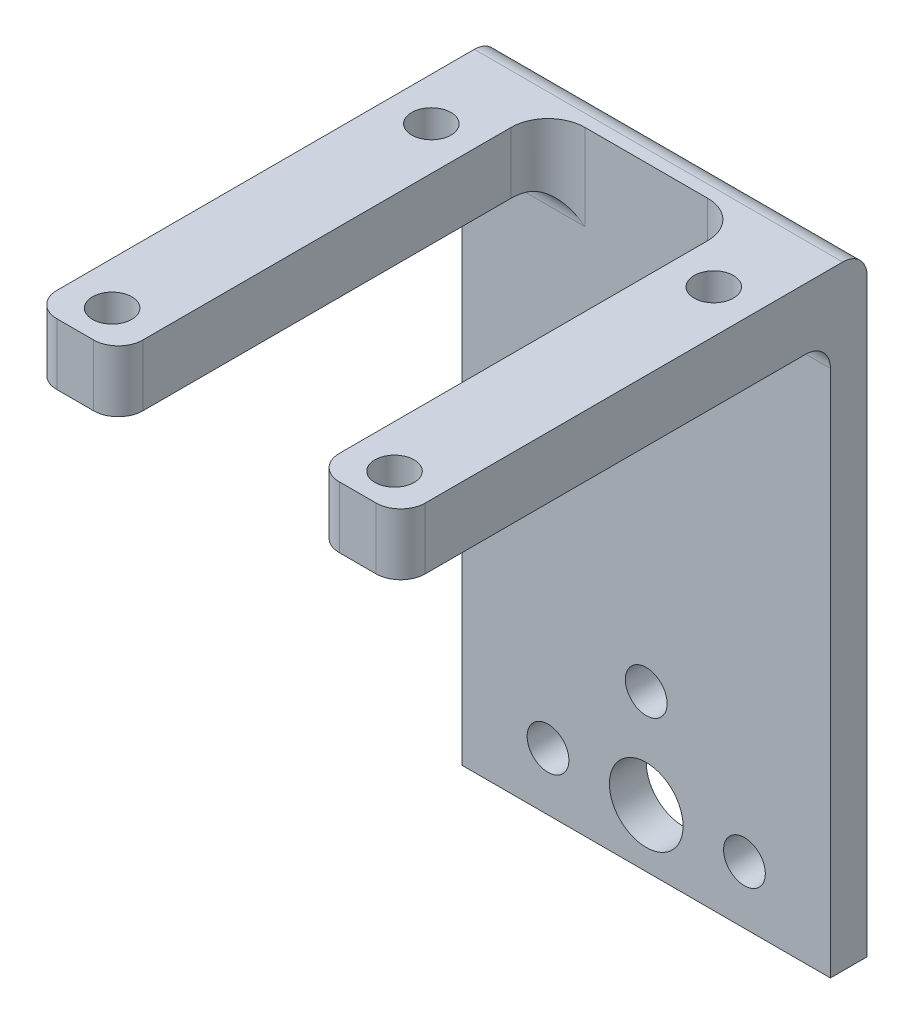
ISO-10303-21;
HEADER;
FILE_DESCRIPTION(('STEP AP214'),'2;1');
FILE_NAME('part.step','',(''),(''),'','','');
FILE_SCHEMA(('AUTOMOTIVE_DESIGN { 1 0 10303 214 1 1 1 1 }'));
ENDSEC;
DATA;
#1=APPLICATION_CONTEXT('core data for automotive mechanical design processes');
#2=APPLICATION_PROTOCOL_DEFINITION('international standard','automotive_design',2000,#1);
#3=PRODUCT_CONTEXT('',#1,'mechanical');
#4=PRODUCT('Part','Part','',(#3));
#5=PRODUCT_RELATED_PRODUCT_CATEGORY('part','',(#4));
#6=PRODUCT_DEFINITION_FORMATION('','',#4);
#7=PRODUCT_DEFINITION_CONTEXT('part definition',#1,'design');
#8=PRODUCT_DEFINITION('design','',#6,#7);
#9=PRODUCT_DEFINITION_SHAPE('','',#8);
#10=(LENGTH_UNIT() NAMED_UNIT(*) SI_UNIT(.MILLI.,.METRE.));
#11=(NAMED_UNIT(*) PLANE_ANGLE_UNIT() SI_UNIT($,.RADIAN.));
#12=(NAMED_UNIT(*) SI_UNIT($,.STERADIAN.) SOLID_ANGLE_UNIT());
#13=UNCERTAINTY_MEASURE_WITH_UNIT(LENGTH_MEASURE(1.E-05),#10,'distance_accuracy_value','');
#14=(GEOMETRIC_REPRESENTATION_CONTEXT(3) GLOBAL_UNCERTAINTY_ASSIGNED_CONTEXT((#13)) GLOBAL_UNIT_ASSIGNED_CONTEXT((#10,
#11,#12)) REPRESENTATION_CONTEXT('',''));
#15=CARTESIAN_POINT('',(0.,0.,0.));
#16=DIRECTION('',(0.,0.,1.));
#17=DIRECTION('',(1.,0.,0.));
#18=AXIS2_PLACEMENT_3D('',#15,#16,#17);
#19=CARTESIAN_POINT('',(-15.,146.664519158712,51.));
#20=DIRECTION('',(0.,1.,0.));
#21=DIRECTION('',(0.,0.,1.));
#22=AXIS2_PLACEMENT_3D('',#19,#20,#21);
#23=PLANE('',#22);
#24=CARTESIAN_POINT('',(-11.5,146.664519158712,22.));
#25=DIRECTION('',(0.,1.,0.));
#26=DIRECTION('',(0.,0.,1.));
#27=AXIS2_PLACEMENT_3D('',#24,#25,#26);
#28=CIRCLE('',#27,1.6);
#29=CARTESIAN_POINT('',(-11.5,146.664519158712,23.6));
#30=VERTEX_POINT('',#29);
#31=EDGE_CURVE('E246',#30,#30,#28,.T.);
#32=ORIENTED_EDGE('',*,*,#31,.T.);
#33=EDGE_LOOP('',(#32));
#34=FACE_BOUND('',#33,.T.);
#35=CARTESIAN_POINT('',(-11.5,146.664519158712,48.));
#36=DIRECTION('',(0.,1.,0.));
#37=DIRECTION('',(0.,0.,1.));
#38=AXIS2_PLACEMENT_3D('',#35,#36,#37);
#39=CIRCLE('',#38,1.6);
#40=CARTESIAN_POINT('',(-11.5,146.664519158712,49.6));
#41=VERTEX_POINT('',#40);
#42=EDGE_CURVE('E242',#41,#41,#39,.T.);
#43=ORIENTED_EDGE('',*,*,#42,.T.);
#44=EDGE_LOOP('',(#43));
#45=FACE_BOUND('',#44,.T.);
#46=DIRECTION('',(1.,0.,0.));
#47=VECTOR('',#46,1.);
#48=CARTESIAN_POINT('',(-15.,146.664519158712,51.));
#49=LINE('',#48,#47);
#50=CARTESIAN_POINT('',(-13.,146.664519158712,51.));
#51=VERTEX_POINT('',#50);
#52=CARTESIAN_POINT('',(-10.,146.664519158712,51.));
#53=VERTEX_POINT('',#52);
#54=EDGE_CURVE('E429',#51,#53,#49,.T.);
#55=ORIENTED_EDGE('',*,*,#54,.F.);
#56=CARTESIAN_POINT('',(-13.,146.664519158712,49.));
#57=DIRECTION('',(0.,1.,0.));
#58=DIRECTION('',(0.,0.,1.));
#59=AXIS2_PLACEMENT_3D('',#56,#57,#58);
#60=CIRCLE('',#59,2.);
#61=CARTESIAN_POINT('',(-15.,146.664519158712,49.));
#62=VERTEX_POINT('',#61);
#63=EDGE_CURVE('E301',#51,#62,#60,.F.);
#64=ORIENTED_EDGE('',*,*,#63,.T.);
#65=DIRECTION('',(0.,0.,-1.));
#66=VECTOR('',#65,1.);
#67=CARTESIAN_POINT('',(-15.,146.664519158712,51.));
#68=LINE('',#67,#66);
#69=CARTESIAN_POINT('',(-15.,146.664519158712,18.));
#70=VERTEX_POINT('',#69);
#71=EDGE_CURVE('E358',#62,#70,#68,.T.);
#72=ORIENTED_EDGE('',*,*,#71,.T.);
#73=DIRECTION('',(1.,0.,0.));
#74=VECTOR('',#73,1.);
#75=CARTESIAN_POINT('',(-15.,146.664519158712,18.));
#76=LINE('',#75,#74);
#77=CARTESIAN_POINT('',(-7.82842712474619,146.664519158712,18.));
#78=VERTEX_POINT('',#77);
#79=EDGE_CURVE('E230',#70,#78,#76,.T.);
#80=ORIENTED_EDGE('',*,*,#79,.T.);
#81=CARTESIAN_POINT('',(-5.,146.664519158712,19.));
#82=DIRECTION('',(0.,1.,0.));
#83=DIRECTION('',(0.,0.,1.));
#84=AXIS2_PLACEMENT_3D('',#81,#82,#83);
#85=CIRCLE('',#84,3.);
#86=CARTESIAN_POINT('',(-8.,146.664519158712,19.));
#87=VERTEX_POINT('',#86);
#88=EDGE_CURVE('E219',#78,#87,#85,.T.);
#89=ORIENTED_EDGE('',*,*,#88,.T.);
#90=DIRECTION('',(0.,0.,-1.));
#91=VECTOR('',#90,1.);
#92=CARTESIAN_POINT('',(-8.,146.664519158712,51.));
#93=LINE('',#92,#91);
#94=CARTESIAN_POINT('',(-8.,146.664519158712,49.));
#95=VERTEX_POINT('',#94);
#96=EDGE_CURVE('E451',#95,#87,#93,.T.);
#97=ORIENTED_EDGE('',*,*,#96,.F.);
#98=CARTESIAN_POINT('',(-10.,146.664519158712,49.));
#99=DIRECTION('',(0.,1.,0.));
#100=DIRECTION('',(0.,0.,1.));
#101=AXIS2_PLACEMENT_3D('',#98,#99,#100);
#102=CIRCLE('',#101,2.);
#103=EDGE_CURVE('E299',#95,#53,#102,.F.);
#104=ORIENTED_EDGE('',*,*,#103,.T.);
#105=EDGE_LOOP('',(#55,#64,#72,#80,#89,#97,#104));
#106=FACE_BOUND('',#105,.T.);
#107=ADVANCED_FACE('F44',(#34,#45,#106),#23,.F.);
#108=CARTESIAN_POINT('',(0.,0.,51.));
#109=DIRECTION('',(0.,0.,1.));
#110=DIRECTION('',(1.,0.,0.));
#111=AXIS2_PLACEMENT_3D('',#108,#109,#110);
#112=PLANE('',#111);
#113=DIRECTION('',(-1.,0.,0.));
#114=VECTOR('',#113,1.);
#115=CARTESIAN_POINT('',(-15.,151.664519158712,51.));
#116=LINE('',#115,#114);
#117=CARTESIAN_POINT('',(-10.,151.664519158712,51.));
#118=VERTEX_POINT('',#117);
#119=CARTESIAN_POINT('',(-13.,151.664519158712,51.));
#120=VERTEX_POINT('',#119);
#121=EDGE_CURVE('E459',#118,#120,#116,.T.);
#122=ORIENTED_EDGE('',*,*,#121,.T.);
#123=DIRECTION('',(0.,-1.,0.));
#124=VECTOR('',#123,1.);
#125=CARTESIAN_POINT('',(-13.,146.664519158712,51.));
#126=LINE('',#125,#124);
#127=EDGE_CURVE('E296',#120,#51,#126,.T.);
#128=ORIENTED_EDGE('',*,*,#127,.T.);
#129=ORIENTED_EDGE('',*,*,#54,.T.);
#130=DIRECTION('',(0.,-1.,0.));
#131=VECTOR('',#130,1.);
#132=CARTESIAN_POINT('',(-10.,151.664519158712,51.));
#133=LINE('',#132,#131);
#134=EDGE_CURVE('E293',#53,#118,#133,.F.);
#135=ORIENTED_EDGE('',*,*,#134,.T.);
#136=EDGE_LOOP('',(#122,#128,#129,#135));
#137=FACE_BOUND('',#136,.T.);
#138=ADVANCED_FACE('F393',(#137),#112,.T.);
#139=CARTESIAN_POINT('',(15.,0.,16.));
#140=DIRECTION('',(1.,0.,0.));
#141=DIRECTION('',(0.,1.,0.));
#142=AXIS2_PLACEMENT_3D('',#139,#140,#141);
#143=PLANE('',#142);
#144=DIRECTION('',(0.,-1.,0.));
#145=VECTOR('',#144,1.);
#146=CARTESIAN_POINT('',(15.,0.,13.));
#147=LINE('',#146,#145);
#148=CARTESIAN_POINT('',(15.,149.664519158712,13.));
#149=VERTEX_POINT('',#148);
#150=CARTESIAN_POINT('',(15.,101.664519158712,13.));
#151=VERTEX_POINT('',#150);
#152=EDGE_CURVE('E336',#149,#151,#147,.T.);
#153=ORIENTED_EDGE('',*,*,#152,.F.);
#154=CARTESIAN_POINT('',(15.,149.664519158712,15.));
#155=DIRECTION('',(1.,0.,0.));
#156=DIRECTION('',(0.,1.,0.));
#157=AXIS2_PLACEMENT_3D('',#154,#155,#156);
#158=CIRCLE('',#157,2.);
#159=CARTESIAN_POINT('',(15.,151.664519158712,15.));
#160=VERTEX_POINT('',#159);
#161=EDGE_CURVE('E66',#149,#160,#158,.T.);
#162=ORIENTED_EDGE('',*,*,#161,.T.);
#163=DIRECTION('',(0.,0.,-1.));
#164=VECTOR('',#163,1.);
#165=CARTESIAN_POINT('',(15.,151.664519158712,16.));
#166=LINE('',#165,#164);
#167=CARTESIAN_POINT('',(15.,151.664519158712,49.));
#168=VERTEX_POINT('',#167);
#169=EDGE_CURVE('E204',#168,#160,#166,.T.);
#170=ORIENTED_EDGE('',*,*,#169,.F.);
#171=DIRECTION('',(0.,1.,0.));
#172=VECTOR('',#171,1.);
#173=CARTESIAN_POINT('',(15.,0.,49.));
#174=LINE('',#173,#172);
#175=CARTESIAN_POINT('',(15.,146.664519158712,49.));
#176=VERTEX_POINT('',#175);
#177=EDGE_CURVE('E328',#168,#176,#174,.F.);
#178=ORIENTED_EDGE('',*,*,#177,.T.);
#179=DIRECTION('',(0.,0.,-1.));
#180=VECTOR('',#179,1.);
#181=CARTESIAN_POINT('',(15.,146.664519158712,51.));
#182=LINE('',#181,#180);
#183=CARTESIAN_POINT('',(15.,146.664519158712,18.));
#184=VERTEX_POINT('',#183);
#185=EDGE_CURVE('E458',#176,#184,#182,.T.);
#186=ORIENTED_EDGE('',*,*,#185,.T.);
#187=CARTESIAN_POINT('',(15.,144.664519158712,18.));
#188=DIRECTION('',(1.,0.,0.));
#189=DIRECTION('',(0.,1.,0.));
#190=AXIS2_PLACEMENT_3D('',#187,#188,#189);
#191=CIRCLE('',#190,2.);
#192=CARTESIAN_POINT('',(15.,144.664519158712,16.));
#193=VERTEX_POINT('',#192);
#194=EDGE_CURVE('E294',#184,#193,#191,.F.);
#195=ORIENTED_EDGE('',*,*,#194,.T.);
#196=DIRECTION('',(0.,-1.,0.));
#197=VECTOR('',#196,1.);
#198=CARTESIAN_POINT('',(15.,0.,16.));
#199=LINE('',#198,#197);
#200=CARTESIAN_POINT('',(15.,101.664519158712,16.));
#201=VERTEX_POINT('',#200);
#202=EDGE_CURVE('E188',#193,#201,#199,.T.);
#203=ORIENTED_EDGE('',*,*,#202,.T.);
#204=DIRECTION('',(0.,0.,-1.));
#205=VECTOR('',#204,1.);
#206=CARTESIAN_POINT('',(15.,101.664519158712,16.));
#207=LINE('',#206,#205);
#208=EDGE_CURVE('E196',#201,#151,#207,.T.);
#209=ORIENTED_EDGE('',*,*,#208,.T.);
#210=EDGE_LOOP('',(#153,#162,#170,#178,#186,#195,#203,#209));
#211=FACE_BOUND('',#210,.T.);
#212=ADVANCED_FACE('F339',(#211),#143,.T.);
#213=CARTESIAN_POINT('',(0.,151.664519158712,16.));
#214=DIRECTION('',(0.,1.,0.));
#215=DIRECTION('',(0.,0.,1.));
#216=AXIS2_PLACEMENT_3D('',#213,#214,#215);
#217=PLANE('',#216);
#218=CARTESIAN_POINT('',(-11.5,151.664519158712,22.));
#219=DIRECTION('',(0.,1.,0.));
#220=DIRECTION('',(0.,0.,1.));
#221=AXIS2_PLACEMENT_3D('',#218,#219,#220);
#222=CIRCLE('',#221,1.6);
#223=CARTESIAN_POINT('',(-11.5,151.664519158712,23.6));
#224=VERTEX_POINT('',#223);
#225=EDGE_CURVE('E243',#224,#224,#222,.T.);
#226=ORIENTED_EDGE('',*,*,#225,.F.);
#227=EDGE_LOOP('',(#226));
#228=FACE_BOUND('',#227,.T.);
#229=CARTESIAN_POINT('',(-11.5,151.664519158712,48.));
#230=DIRECTION('',(0.,1.,0.));
#231=DIRECTION('',(0.,0.,1.));
#232=AXIS2_PLACEMENT_3D('',#229,#230,#231);
#233=CIRCLE('',#232,1.6);
#234=CARTESIAN_POINT('',(-11.5,151.664519158712,49.6));
#235=VERTEX_POINT('',#234);
#236=EDGE_CURVE('E239',#235,#235,#233,.T.);
#237=ORIENTED_EDGE('',*,*,#236,.F.);
#238=EDGE_LOOP('',(#237));
#239=FACE_BOUND('',#238,.T.);
#240=CARTESIAN_POINT('',(11.5,151.664519158712,48.));
#241=DIRECTION('',(0.,1.,0.));
#242=DIRECTION('',(0.,0.,1.));
#243=AXIS2_PLACEMENT_3D('',#240,#241,#242);
#244=CIRCLE('',#243,1.6);
#245=CARTESIAN_POINT('',(11.5,151.664519158712,49.6));
#246=VERTEX_POINT('',#245);
#247=EDGE_CURVE('E238',#246,#246,#244,.T.);
#248=ORIENTED_EDGE('',*,*,#247,.F.);
#249=EDGE_LOOP('',(#248));
#250=FACE_BOUND('',#249,.T.);
#251=CARTESIAN_POINT('',(11.5,151.664519158712,22.));
#252=DIRECTION('',(0.,1.,0.));
#253=DIRECTION('',(0.,0.,1.));
#254=AXIS2_PLACEMENT_3D('',#251,#252,#253);
#255=CIRCLE('',#254,1.6);
#256=CARTESIAN_POINT('',(11.5,151.664519158712,23.6));
#257=VERTEX_POINT('',#256);
#258=EDGE_CURVE('E234',#257,#257,#255,.T.);
#259=ORIENTED_EDGE('',*,*,#258,.F.);
#260=EDGE_LOOP('',(#259));
#261=FACE_BOUND('',#260,.T.);
#262=ORIENTED_EDGE('',*,*,#169,.T.);
#263=DIRECTION('',(1.,0.,0.));
#264=VECTOR('',#263,1.);
#265=CARTESIAN_POINT('',(-15.,151.664519158712,15.));
#266=LINE('',#265,#264);
#267=CARTESIAN_POINT('',(-15.,151.664519158712,15.));
#268=VERTEX_POINT('',#267);
#269=EDGE_CURVE('E52',#160,#268,#266,.F.);
#270=ORIENTED_EDGE('',*,*,#269,.T.);
#271=DIRECTION('',(0.,0.,-1.));
#272=VECTOR('',#271,1.);
#273=CARTESIAN_POINT('',(-15.,151.664519158712,16.));
#274=LINE('',#273,#272);
#275=CARTESIAN_POINT('',(-15.,151.664519158712,49.));
#276=VERTEX_POINT('',#275);
#277=EDGE_CURVE('E202',#276,#268,#274,.T.);
#278=ORIENTED_EDGE('',*,*,#277,.F.);
#279=CARTESIAN_POINT('',(-13.,151.664519158712,49.));
#280=DIRECTION('',(0.,1.,0.));
#281=DIRECTION('',(0.,0.,1.));
#282=AXIS2_PLACEMENT_3D('',#279,#280,#281);
#283=CIRCLE('',#282,2.);
#284=EDGE_CURVE('E311',#276,#120,#283,.T.);
#285=ORIENTED_EDGE('',*,*,#284,.T.);
#286=ORIENTED_EDGE('',*,*,#121,.F.);
#287=CARTESIAN_POINT('',(-10.,151.664519158712,49.));
#288=DIRECTION('',(0.,1.,0.));
#289=DIRECTION('',(0.,0.,1.));
#290=AXIS2_PLACEMENT_3D('',#287,#288,#289);
#291=CIRCLE('',#290,2.);
#292=CARTESIAN_POINT('',(-8.,151.664519158712,49.));
#293=VERTEX_POINT('',#292);
#294=EDGE_CURVE('E309',#118,#293,#291,.T.);
#295=ORIENTED_EDGE('',*,*,#294,.T.);
#296=DIRECTION('',(0.,0.,1.));
#297=VECTOR('',#296,1.);
#298=CARTESIAN_POINT('',(-8.,151.664519158712,16.));
#299=LINE('',#298,#297);
#300=CARTESIAN_POINT('',(-8.,151.664519158712,19.));
#301=VERTEX_POINT('',#300);
#302=EDGE_CURVE('E447',#301,#293,#299,.T.);
#303=ORIENTED_EDGE('',*,*,#302,.F.);
#304=CARTESIAN_POINT('',(-5.,151.664519158712,19.));
#305=DIRECTION('',(0.,1.,0.));
#306=DIRECTION('',(0.,0.,1.));
#307=AXIS2_PLACEMENT_3D('',#304,#305,#306);
#308=CIRCLE('',#307,3.);
#309=CARTESIAN_POINT('',(-5.,151.664519158712,16.));
#310=VERTEX_POINT('',#309);
#311=EDGE_CURVE('E222',#301,#310,#308,.F.);
#312=ORIENTED_EDGE('',*,*,#311,.T.);
#313=DIRECTION('',(-1.,0.,0.));
#314=VECTOR('',#313,1.);
#315=CARTESIAN_POINT('',(0.,151.664519158712,16.));
#316=LINE('',#315,#314);
#317=CARTESIAN_POINT('',(5.,151.664519158712,16.));
#318=VERTEX_POINT('',#317);
#319=EDGE_CURVE('E430',#318,#310,#316,.T.);
#320=ORIENTED_EDGE('',*,*,#319,.F.);
#321=CARTESIAN_POINT('',(5.,151.664519158712,19.));
#322=DIRECTION('',(0.,1.,0.));
#323=DIRECTION('',(0.,0.,1.));
#324=AXIS2_PLACEMENT_3D('',#321,#322,#323);
#325=CIRCLE('',#324,3.);
#326=CARTESIAN_POINT('',(8.,151.664519158712,19.));
#327=VERTEX_POINT('',#326);
#328=EDGE_CURVE('E227',#318,#327,#325,.F.);
#329=ORIENTED_EDGE('',*,*,#328,.T.);
#330=DIRECTION('',(0.,0.,-1.));
#331=VECTOR('',#330,1.);
#332=CARTESIAN_POINT('',(8.,151.664519158712,16.));
#333=LINE('',#332,#331);
#334=CARTESIAN_POINT('',(8.,151.664519158712,49.));
#335=VERTEX_POINT('',#334);
#336=EDGE_CURVE('E439',#335,#327,#333,.T.);
#337=ORIENTED_EDGE('',*,*,#336,.F.);
#338=CARTESIAN_POINT('',(10.,151.664519158712,49.));
#339=DIRECTION('',(0.,1.,0.));
#340=DIRECTION('',(0.,0.,1.));
#341=AXIS2_PLACEMENT_3D('',#338,#339,#340);
#342=CIRCLE('',#341,2.);
#343=CARTESIAN_POINT('',(10.,151.664519158712,51.));
#344=VERTEX_POINT('',#343);
#345=EDGE_CURVE('E307',#335,#344,#342,.T.);
#346=ORIENTED_EDGE('',*,*,#345,.T.);
#347=CARTESIAN_POINT('',(13.,151.664519158712,51.));
#348=VERTEX_POINT('',#347);
#349=EDGE_CURVE('E457',#348,#344,#116,.T.);
#350=ORIENTED_EDGE('',*,*,#349,.F.);
#351=CARTESIAN_POINT('',(13.,151.664519158712,49.));
#352=DIRECTION('',(0.,1.,0.));
#353=DIRECTION('',(0.,0.,1.));
#354=AXIS2_PLACEMENT_3D('',#351,#352,#353);
#355=CIRCLE('',#354,2.);
#356=EDGE_CURVE('E305',#348,#168,#355,.T.);
#357=ORIENTED_EDGE('',*,*,#356,.T.);
#358=EDGE_LOOP('',(#262,#270,#278,#285,#286,#295,#303,#312,#320,#329,#337,#346,#350,#357));
#359=FACE_BOUND('',#358,.T.);
#360=ADVANCED_FACE('F441',(#228,#239,#250,#261,#359),#217,.T.);
#361=CARTESIAN_POINT('',(-15.,0.,16.));
#362=DIRECTION('',(1.,0.,0.));
#363=DIRECTION('',(0.,1.,0.));
#364=AXIS2_PLACEMENT_3D('',#361,#362,#363);
#365=PLANE('',#364);
#366=ORIENTED_EDGE('',*,*,#277,.T.);
#367=CARTESIAN_POINT('',(-15.,149.664519158712,15.));
#368=DIRECTION('',(1.,0.,0.));
#369=DIRECTION('',(0.,1.,0.));
#370=AXIS2_PLACEMENT_3D('',#367,#368,#369);
#371=CIRCLE('',#370,2.);
#372=CARTESIAN_POINT('',(-15.,149.664519158712,13.));
#373=VERTEX_POINT('',#372);
#374=EDGE_CURVE('E12',#268,#373,#371,.F.);
#375=ORIENTED_EDGE('',*,*,#374,.T.);
#376=DIRECTION('',(0.,-1.,0.));
#377=VECTOR('',#376,1.);
#378=CARTESIAN_POINT('',(-15.,0.,13.));
#379=LINE('',#378,#377);
#380=CARTESIAN_POINT('',(-15.,101.664519158712,13.));
#381=VERTEX_POINT('',#380);
#382=EDGE_CURVE('E200',#373,#381,#379,.T.);
#383=ORIENTED_EDGE('',*,*,#382,.T.);
#384=DIRECTION('',(0.,0.,-1.));
#385=VECTOR('',#384,1.);
#386=CARTESIAN_POINT('',(-15.,101.664519158712,16.));
#387=LINE('',#386,#385);
#388=CARTESIAN_POINT('',(-15.,101.664519158712,16.));
#389=VERTEX_POINT('',#388);
#390=EDGE_CURVE('E194',#389,#381,#387,.T.);
#391=ORIENTED_EDGE('',*,*,#390,.F.);
#392=DIRECTION('',(0.,-1.,0.));
#393=VECTOR('',#392,1.);
#394=CARTESIAN_POINT('',(-15.,0.,16.));
#395=LINE('',#394,#393);
#396=CARTESIAN_POINT('',(-15.,144.664519158712,16.));
#397=VERTEX_POINT('',#396);
#398=EDGE_CURVE('E175',#397,#389,#395,.T.);
#399=ORIENTED_EDGE('',*,*,#398,.F.);
#400=CARTESIAN_POINT('',(-15.,144.664519158712,18.));
#401=DIRECTION('',(1.,0.,0.));
#402=DIRECTION('',(0.,1.,0.));
#403=AXIS2_PLACEMENT_3D('',#400,#401,#402);
#404=CIRCLE('',#403,2.);
#405=EDGE_CURVE('E265',#397,#70,#404,.T.);
#406=ORIENTED_EDGE('',*,*,#405,.T.);
#407=ORIENTED_EDGE('',*,*,#71,.F.);
#408=DIRECTION('',(0.,-1.,0.));
#409=VECTOR('',#408,1.);
#410=CARTESIAN_POINT('',(-15.,151.664519158712,49.));
#411=LINE('',#410,#409);
#412=EDGE_CURVE('E303',#62,#276,#411,.F.);
#413=ORIENTED_EDGE('',*,*,#412,.T.);
#414=EDGE_LOOP('',(#366,#375,#383,#391,#399,#406,#407,#413));
#415=FACE_BOUND('',#414,.T.);
#416=ADVANCED_FACE('F198',(#415),#365,.F.);
#417=CARTESIAN_POINT('',(0.,114.371786435132,16.));
#418=DIRECTION('',(0.,0.,-1.));
#419=DIRECTION('',(-1.,0.,0.));
#420=AXIS2_PLACEMENT_3D('',#417,#418,#419);
#421=CYLINDRICAL_SURFACE('',#420,1.7);
#422=CARTESIAN_POINT('',(0.,114.371786435132,16.));
#423=DIRECTION('',(0.,0.,1.));
#424=DIRECTION('',(1.,0.,0.));
#425=AXIS2_PLACEMENT_3D('',#422,#423,#424);
#426=CIRCLE('',#425,1.7);
#427=CARTESIAN_POINT('',(1.7,114.371786435132,16.));
#428=VERTEX_POINT('',#427);
#429=EDGE_CURVE('E363',#428,#428,#426,.T.);
#430=ORIENTED_EDGE('',*,*,#429,.T.);
#431=EDGE_LOOP('',(#430));
#432=FACE_BOUND('',#431,.T.);
#433=CARTESIAN_POINT('',(0.,114.371786435132,13.));
#434=DIRECTION('',(0.,0.,1.));
#435=DIRECTION('',(1.,0.,0.));
#436=AXIS2_PLACEMENT_3D('',#433,#434,#435);
#437=CIRCLE('',#436,1.7);
#438=CARTESIAN_POINT('',(1.7,114.371786435132,13.));
#439=VERTEX_POINT('',#438);
#440=EDGE_CURVE('E340',#439,#439,#437,.T.);
#441=ORIENTED_EDGE('',*,*,#440,.F.);
#442=EDGE_LOOP('',(#441));
#443=FACE_BOUND('',#442,.T.);
#444=ADVANCED_FACE('F380',(#432,#443),#421,.F.);
#445=CARTESIAN_POINT('',(8.,106.371786435132,16.));
#446=DIRECTION('',(0.,0.,-1.));
#447=DIRECTION('',(-1.,0.,0.));
#448=AXIS2_PLACEMENT_3D('',#445,#446,#447);
#449=CYLINDRICAL_SURFACE('',#448,1.7);
#450=CARTESIAN_POINT('',(8.,106.371786435132,16.));
#451=DIRECTION('',(0.,0.,1.));
#452=DIRECTION('',(1.,0.,0.));
#453=AXIS2_PLACEMENT_3D('',#450,#451,#452);
#454=CIRCLE('',#453,1.7);
#455=CARTESIAN_POINT('',(9.7,106.371786435132,16.));
#456=VERTEX_POINT('',#455);
#457=EDGE_CURVE('E355',#456,#456,#454,.T.);
#458=ORIENTED_EDGE('',*,*,#457,.T.);
#459=EDGE_LOOP('',(#458));
#460=FACE_BOUND('',#459,.T.);
#461=CARTESIAN_POINT('',(8.,106.371786435132,13.));
#462=DIRECTION('',(0.,0.,1.));
#463=DIRECTION('',(1.,0.,0.));
#464=AXIS2_PLACEMENT_3D('',#461,#462,#463);
#465=CIRCLE('',#464,1.7);
#466=CARTESIAN_POINT('',(9.7,106.371786435132,13.));
#467=VERTEX_POINT('',#466);
#468=EDGE_CURVE('E345',#467,#467,#465,.T.);
#469=ORIENTED_EDGE('',*,*,#468,.F.);
#470=EDGE_LOOP('',(#469));
#471=FACE_BOUND('',#470,.T.);
#472=ADVANCED_FACE('F377',(#460,#471),#449,.F.);
#473=CARTESIAN_POINT('',(-8.,106.371786435132,16.));
#474=DIRECTION('',(0.,0.,-1.));
#475=DIRECTION('',(-1.,0.,0.));
#476=AXIS2_PLACEMENT_3D('',#473,#474,#475);
#477=CYLINDRICAL_SURFACE('',#476,1.7);
#478=CARTESIAN_POINT('',(-8.,106.371786435132,16.));
#479=DIRECTION('',(0.,0.,1.));
#480=DIRECTION('',(1.,0.,0.));
#481=AXIS2_PLACEMENT_3D('',#478,#479,#480);
#482=CIRCLE('',#481,1.7);
#483=CARTESIAN_POINT('',(-6.3,106.371786435132,16.));
#484=VERTEX_POINT('',#483);
#485=EDGE_CURVE('E350',#484,#484,#482,.T.);
#486=ORIENTED_EDGE('',*,*,#485,.T.);
#487=EDGE_LOOP('',(#486));
#488=FACE_BOUND('',#487,.T.);
#489=CARTESIAN_POINT('',(-8.,106.371786435132,13.));
#490=DIRECTION('',(0.,0.,1.));
#491=DIRECTION('',(1.,0.,0.));
#492=AXIS2_PLACEMENT_3D('',#489,#490,#491);
#493=CIRCLE('',#492,1.7);
#494=CARTESIAN_POINT('',(-6.3,106.371786435132,13.));
#495=VERTEX_POINT('',#494);
#496=EDGE_CURVE('E370',#495,#495,#493,.T.);
#497=ORIENTED_EDGE('',*,*,#496,.F.);
#498=EDGE_LOOP('',(#497));
#499=FACE_BOUND('',#498,.T.);
#500=ADVANCED_FACE('F379',(#488,#499),#477,.F.);
#501=CARTESIAN_POINT('',(0.,106.371786435132,16.));
#502=DIRECTION('',(0.,0.,-1.));
#503=DIRECTION('',(-1.,0.,0.));
#504=AXIS2_PLACEMENT_3D('',#501,#502,#503);
#505=CYLINDRICAL_SURFACE('',#504,3.);
#506=CARTESIAN_POINT('',(0.,106.371786435132,16.));
#507=DIRECTION('',(0.,0.,1.));
#508=DIRECTION('',(1.,0.,0.));
#509=AXIS2_PLACEMENT_3D('',#506,#507,#508);
#510=CIRCLE('',#509,3.);
#511=CARTESIAN_POINT('',(3.,106.371786435132,16.));
#512=VERTEX_POINT('',#511);
#513=EDGE_CURVE('E348',#512,#512,#510,.T.);
#514=ORIENTED_EDGE('',*,*,#513,.T.);
#515=EDGE_LOOP('',(#514));
#516=FACE_BOUND('',#515,.T.);
#517=CARTESIAN_POINT('',(0.,106.371786435132,13.));
#518=DIRECTION('',(0.,0.,1.));
#519=DIRECTION('',(1.,0.,0.));
#520=AXIS2_PLACEMENT_3D('',#517,#518,#519);
#521=CIRCLE('',#520,3.);
#522=CARTESIAN_POINT('',(3.,106.371786435132,13.));
#523=VERTEX_POINT('',#522);
#524=EDGE_CURVE('E367',#523,#523,#521,.T.);
#525=ORIENTED_EDGE('',*,*,#524,.F.);
#526=EDGE_LOOP('',(#525));
#527=FACE_BOUND('',#526,.T.);
#528=ADVANCED_FACE('F387',(#516,#527),#505,.F.);
#529=CARTESIAN_POINT('',(0.,101.664519158712,16.));
#530=DIRECTION('',(0.,1.,0.));
#531=DIRECTION('',(0.,0.,1.));
#532=AXIS2_PLACEMENT_3D('',#529,#530,#531);
#533=PLANE('',#532);
#534=DIRECTION('',(1.,0.,0.));
#535=VECTOR('',#534,1.);
#536=CARTESIAN_POINT('',(0.,101.664519158712,13.));
#537=LINE('',#536,#535);
#538=EDGE_CURVE('E342',#381,#151,#537,.T.);
#539=ORIENTED_EDGE('',*,*,#538,.T.);
#540=ORIENTED_EDGE('',*,*,#208,.F.);
#541=DIRECTION('',(1.,0.,0.));
#542=VECTOR('',#541,1.);
#543=CARTESIAN_POINT('',(0.,101.664519158712,16.));
#544=LINE('',#543,#542);
#545=EDGE_CURVE('E180',#389,#201,#544,.T.);
#546=ORIENTED_EDGE('',*,*,#545,.F.);
#547=ORIENTED_EDGE('',*,*,#390,.T.);
#548=EDGE_LOOP('',(#539,#540,#546,#547));
#549=FACE_BOUND('',#548,.T.);
#550=ADVANCED_FACE('F193',(#549),#533,.F.);
#551=CARTESIAN_POINT('',(0.,0.,16.));
#552=DIRECTION('',(0.,0.,1.));
#553=DIRECTION('',(1.,0.,0.));
#554=AXIS2_PLACEMENT_3D('',#551,#552,#553);
#555=PLANE('',#554);
#556=DIRECTION('',(0.,-1.,0.));
#557=VECTOR('',#556,1.);
#558=CARTESIAN_POINT('',(-5.,0.,16.));
#559=LINE('',#558,#557);
#560=CARTESIAN_POINT('',(-5.,144.664519158712,16.));
#561=VERTEX_POINT('',#560);
#562=EDGE_CURVE('E212',#310,#561,#559,.T.);
#563=ORIENTED_EDGE('',*,*,#562,.T.);
#564=DIRECTION('',(1.,0.,0.));
#565=VECTOR('',#564,1.);
#566=CARTESIAN_POINT('',(0.,144.664519158712,16.));
#567=LINE('',#566,#565);
#568=EDGE_CURVE('E183',#561,#397,#567,.F.);
#569=ORIENTED_EDGE('',*,*,#568,.T.);
#570=ORIENTED_EDGE('',*,*,#398,.T.);
#571=ORIENTED_EDGE('',*,*,#545,.T.);
#572=ORIENTED_EDGE('',*,*,#202,.F.);
#573=DIRECTION('',(1.,0.,0.));
#574=VECTOR('',#573,1.);
#575=CARTESIAN_POINT('',(0.,144.664519158712,16.));
#576=LINE('',#575,#574);
#577=CARTESIAN_POINT('',(5.,144.664519158712,16.));
#578=VERTEX_POINT('',#577);
#579=EDGE_CURVE('E249',#193,#578,#576,.F.);
#580=ORIENTED_EDGE('',*,*,#579,.T.);
#581=DIRECTION('',(0.,-1.,0.));
#582=VECTOR('',#581,1.);
#583=CARTESIAN_POINT('',(5.,0.,16.));
#584=LINE('',#583,#582);
#585=EDGE_CURVE('E210',#578,#318,#584,.F.);
#586=ORIENTED_EDGE('',*,*,#585,.T.);
#587=ORIENTED_EDGE('',*,*,#319,.T.);
#588=EDGE_LOOP('',(#563,#569,#570,#571,#572,#580,#586,#587));
#589=FACE_BOUND('',#588,.T.);
#590=ORIENTED_EDGE('',*,*,#513,.F.);
#591=EDGE_LOOP('',(#590));
#592=FACE_BOUND('',#591,.T.);
#593=ORIENTED_EDGE('',*,*,#485,.F.);
#594=EDGE_LOOP('',(#593));
#595=FACE_BOUND('',#594,.T.);
#596=ORIENTED_EDGE('',*,*,#457,.F.);
#597=EDGE_LOOP('',(#596));
#598=FACE_BOUND('',#597,.T.);
#599=ORIENTED_EDGE('',*,*,#429,.F.);
#600=EDGE_LOOP('',(#599));
#601=FACE_BOUND('',#600,.T.);
#602=ADVANCED_FACE('F177',(#589,#592,#595,#598,#601),#555,.T.);
#603=CARTESIAN_POINT('',(0.,0.,13.));
#604=DIRECTION('',(0.,0.,1.));
#605=DIRECTION('',(1.,0.,0.));
#606=AXIS2_PLACEMENT_3D('',#603,#604,#605);
#607=PLANE('',#606);
#608=ORIENTED_EDGE('',*,*,#524,.T.);
#609=EDGE_LOOP('',(#608));
#610=FACE_BOUND('',#609,.T.);
#611=ORIENTED_EDGE('',*,*,#496,.T.);
#612=EDGE_LOOP('',(#611));
#613=FACE_BOUND('',#612,.T.);
#614=ORIENTED_EDGE('',*,*,#468,.T.);
#615=EDGE_LOOP('',(#614));
#616=FACE_BOUND('',#615,.T.);
#617=ORIENTED_EDGE('',*,*,#440,.T.);
#618=EDGE_LOOP('',(#617));
#619=FACE_BOUND('',#618,.T.);
#620=ORIENTED_EDGE('',*,*,#382,.F.);
#621=DIRECTION('',(1.,0.,0.));
#622=VECTOR('',#621,1.);
#623=CARTESIAN_POINT('',(15.,149.664519158712,13.));
#624=LINE('',#623,#622);
#625=EDGE_CURVE('E330',#373,#149,#624,.T.);
#626=ORIENTED_EDGE('',*,*,#625,.T.);
#627=ORIENTED_EDGE('',*,*,#152,.T.);
#628=ORIENTED_EDGE('',*,*,#538,.F.);
#629=EDGE_LOOP('',(#620,#626,#627,#628));
#630=FACE_BOUND('',#629,.T.);
#631=ADVANCED_FACE('F335',(#610,#613,#616,#619,#630),#607,.F.);
#632=CARTESIAN_POINT('',(11.5,146.664519158712,48.));
#633=DIRECTION('',(0.,1.,0.));
#634=DIRECTION('',(0.,0.,1.));
#635=AXIS2_PLACEMENT_3D('',#632,#633,#634);
#636=CIRCLE('',#635,1.6);
#637=CARTESIAN_POINT('',(11.5,146.664519158712,49.6));
#638=VERTEX_POINT('',#637);
#639=EDGE_CURVE('E235',#638,#638,#636,.T.);
#640=ORIENTED_EDGE('',*,*,#639,.T.);
#641=EDGE_LOOP('',(#640));
#642=FACE_BOUND('',#641,.T.);
#643=CARTESIAN_POINT('',(11.5,146.664519158712,22.));
#644=DIRECTION('',(0.,1.,0.));
#645=DIRECTION('',(0.,0.,1.));
#646=AXIS2_PLACEMENT_3D('',#643,#644,#645);
#647=CIRCLE('',#646,1.6);
#648=CARTESIAN_POINT('',(11.5,146.664519158712,23.6));
#649=VERTEX_POINT('',#648);
#650=EDGE_CURVE('E231',#649,#649,#647,.T.);
#651=ORIENTED_EDGE('',*,*,#650,.T.);
#652=EDGE_LOOP('',(#651));
#653=FACE_BOUND('',#652,.T.);
#654=CARTESIAN_POINT('',(10.,146.664519158712,51.));
#655=VERTEX_POINT('',#654);
#656=CARTESIAN_POINT('',(13.,146.664519158712,51.));
#657=VERTEX_POINT('',#656);
#658=EDGE_CURVE('E422',#655,#657,#49,.T.);
#659=ORIENTED_EDGE('',*,*,#658,.F.);
#660=CARTESIAN_POINT('',(10.,146.664519158712,49.));
#661=DIRECTION('',(0.,1.,0.));
#662=DIRECTION('',(0.,0.,1.));
#663=AXIS2_PLACEMENT_3D('',#660,#661,#662);
#664=CIRCLE('',#663,2.);
#665=CARTESIAN_POINT('',(8.,146.664519158712,49.));
#666=VERTEX_POINT('',#665);
#667=EDGE_CURVE('E326',#655,#666,#664,.F.);
#668=ORIENTED_EDGE('',*,*,#667,.T.);
#669=DIRECTION('',(0.,0.,1.));
#670=VECTOR('',#669,1.);
#671=CARTESIAN_POINT('',(8.,146.664519158712,51.));
#672=LINE('',#671,#670);
#673=CARTESIAN_POINT('',(8.,146.664519158712,19.));
#674=VERTEX_POINT('',#673);
#675=EDGE_CURVE('E440',#674,#666,#672,.T.);
#676=ORIENTED_EDGE('',*,*,#675,.F.);
#677=CARTESIAN_POINT('',(5.,146.664519158712,19.));
#678=DIRECTION('',(0.,1.,0.));
#679=DIRECTION('',(0.,0.,1.));
#680=AXIS2_PLACEMENT_3D('',#677,#678,#679);
#681=CIRCLE('',#680,3.);
#682=CARTESIAN_POINT('',(7.8284271247462,146.664519158712,18.));
#683=VERTEX_POINT('',#682);
#684=EDGE_CURVE('E224',#674,#683,#681,.T.);
#685=ORIENTED_EDGE('',*,*,#684,.T.);
#686=DIRECTION('',(1.,0.,0.));
#687=VECTOR('',#686,1.);
#688=CARTESIAN_POINT('',(-15.,146.664519158712,18.));
#689=LINE('',#688,#687);
#690=EDGE_CURVE('E253',#683,#184,#689,.T.);
#691=ORIENTED_EDGE('',*,*,#690,.T.);
#692=ORIENTED_EDGE('',*,*,#185,.F.);
#693=CARTESIAN_POINT('',(13.,146.664519158712,49.));
#694=DIRECTION('',(0.,1.,0.));
#695=DIRECTION('',(0.,0.,1.));
#696=AXIS2_PLACEMENT_3D('',#693,#694,#695);
#697=CIRCLE('',#696,2.);
#698=EDGE_CURVE('E324',#176,#657,#697,.F.);
#699=ORIENTED_EDGE('',*,*,#698,.T.);
#700=EDGE_LOOP('',(#659,#668,#676,#685,#691,#692,#699));
#701=FACE_BOUND('',#700,.T.);
#702=ADVANCED_FACE('F396',(#642,#653,#701),#23,.F.);
#703=ORIENTED_EDGE('',*,*,#349,.T.);
#704=DIRECTION('',(0.,1.,0.));
#705=VECTOR('',#704,1.);
#706=CARTESIAN_POINT('',(10.,146.664519158712,51.));
#707=LINE('',#706,#705);
#708=EDGE_CURVE('E322',#344,#655,#707,.F.);
#709=ORIENTED_EDGE('',*,*,#708,.T.);
#710=ORIENTED_EDGE('',*,*,#658,.T.);
#711=DIRECTION('',(0.,1.,0.));
#712=VECTOR('',#711,1.);
#713=CARTESIAN_POINT('',(13.,0.,51.));
#714=LINE('',#713,#712);
#715=EDGE_CURVE('E319',#657,#348,#714,.T.);
#716=ORIENTED_EDGE('',*,*,#715,.T.);
#717=EDGE_LOOP('',(#703,#709,#710,#716));
#718=FACE_BOUND('',#717,.T.);
#719=ADVANCED_FACE('F402',(#718),#112,.T.);
#720=CARTESIAN_POINT('',(-8.,181.664519158712,51.));
#721=DIRECTION('',(-1.,0.,0.));
#722=DIRECTION('',(0.,0.,1.));
#723=AXIS2_PLACEMENT_3D('',#720,#721,#722);
#724=PLANE('',#723);
#725=ORIENTED_EDGE('',*,*,#302,.T.);
#726=DIRECTION('',(0.,-1.,0.));
#727=VECTOR('',#726,1.);
#728=CARTESIAN_POINT('',(-8.,146.664519158712,49.));
#729=LINE('',#728,#727);
#730=EDGE_CURVE('E313',#293,#95,#729,.T.);
#731=ORIENTED_EDGE('',*,*,#730,.T.);
#732=ORIENTED_EDGE('',*,*,#96,.T.);
#733=DIRECTION('',(0.,-1.,0.));
#734=VECTOR('',#733,1.);
#735=CARTESIAN_POINT('',(-8.,181.664519158712,19.));
#736=LINE('',#735,#734);
#737=EDGE_CURVE('E214',#87,#301,#736,.F.);
#738=ORIENTED_EDGE('',*,*,#737,.T.);
#739=EDGE_LOOP('',(#725,#731,#732,#738));
#740=FACE_BOUND('',#739,.T.);
#741=ADVANCED_FACE('F412',(#740),#724,.F.);
#742=CARTESIAN_POINT('',(8.,181.664519158712,51.));
#743=DIRECTION('',(1.,0.,0.));
#744=DIRECTION('',(0.,0.,-1.));
#745=AXIS2_PLACEMENT_3D('',#742,#743,#744);
#746=PLANE('',#745);
#747=ORIENTED_EDGE('',*,*,#675,.T.);
#748=DIRECTION('',(0.,1.,0.));
#749=VECTOR('',#748,1.);
#750=CARTESIAN_POINT('',(8.,151.664519158712,49.));
#751=LINE('',#750,#749);
#752=EDGE_CURVE('E316',#666,#335,#751,.T.);
#753=ORIENTED_EDGE('',*,*,#752,.T.);
#754=ORIENTED_EDGE('',*,*,#336,.T.);
#755=DIRECTION('',(0.,-1.,0.));
#756=VECTOR('',#755,1.);
#757=CARTESIAN_POINT('',(8.,181.664519158712,19.));
#758=LINE('',#757,#756);
#759=EDGE_CURVE('E216',#327,#674,#758,.T.);
#760=ORIENTED_EDGE('',*,*,#759,.T.);
#761=EDGE_LOOP('',(#747,#753,#754,#760));
#762=FACE_BOUND('',#761,.T.);
#763=ADVANCED_FACE('F438',(#762),#746,.F.);
#764=CARTESIAN_POINT('',(-5.,0.,19.));
#765=DIRECTION('',(0.,-1.,0.));
#766=DIRECTION('',(0.,0.,-1.));
#767=AXIS2_PLACEMENT_3D('',#764,#765,#766);
#768=CYLINDRICAL_SURFACE('',#767,3.);
#769=ORIENTED_EDGE('',*,*,#311,.F.);
#770=ORIENTED_EDGE('',*,*,#737,.F.);
#771=ORIENTED_EDGE('',*,*,#88,.F.);
#772=CARTESIAN_POINT('',(-7.82842712474619,146.664519158712,18.));
#773=CARTESIAN_POINT('',(-7.80850705026881,146.664527603677,17.9436159444474));
#774=CARTESIAN_POINT('',(-7.78688697304804,146.662135687755,17.8878690947585));
#775=CARTESIAN_POINT('',(-7.74054721221958,146.652935261852,17.7781490278589));
#776=CARTESIAN_POINT('',(-7.71583232131467,146.646133514432,17.724173227643));
#777=CARTESIAN_POINT('',(-7.66380432454248,146.628584167677,17.6188529678947));
#778=CARTESIAN_POINT('',(-7.63651992237465,146.617877036928,17.5674874674883));
#779=CARTESIAN_POINT('',(-7.57942991880867,146.592902501798,17.4670669910103));
#780=CARTESIAN_POINT('',(-7.54962313396699,146.578633420042,17.4180131164919));
#781=CARTESIAN_POINT('',(-7.44276479519334,146.523846065069,17.2528931537753));
#782=CARTESIAN_POINT('',(-7.36000930873025,146.475318282314,17.1430488576841));
#783=CARTESIAN_POINT('',(-7.18447181665515,146.364099029603,16.9393380382731));
#784=CARTESIAN_POINT('',(-7.0916463864372,146.301344833742,16.8455456046729));
#785=CARTESIAN_POINT('',(-6.86169239665385,146.139452475707,16.6407427963696));
#786=CARTESIAN_POINT('',(-6.72131415806269,146.035629370738,16.5371027212904));
#787=CARTESIAN_POINT('',(-6.43222170945855,145.815810730769,16.3584666820652));
#788=CARTESIAN_POINT('',(-6.2834961236369,145.699798386895,16.2835109521063));
#789=CARTESIAN_POINT('',(-6.04088627765067,145.50776108619,16.184633309677));
#790=CARTESIAN_POINT('',(-5.94852308440831,145.434024192234,16.1522452036373));
#791=CARTESIAN_POINT('',(-5.76251278895407,145.284644206236,16.0968977952398));
#792=CARTESIAN_POINT('',(-5.66886527305593,145.209000493095,16.0739416083367));
#793=CARTESIAN_POINT('',(-5.38710974946391,144.980585134369,16.0189448512698));
#794=CARTESIAN_POINT('',(-5.19761167412207,144.825868300975,16.0005465936659));
#795=CARTESIAN_POINT('',(-5.00565676976018,144.669137890069,16.0000040048188));
#796=CARTESIAN_POINT('',(-5.00282833958416,144.666828486457,16.0000000052154));
#797=CARTESIAN_POINT('',(-5.,144.664519158712,16.));
#798=B_SPLINE_CURVE_WITH_KNOTS('',3,(#772,#773,#774,#775,#776,#777,#778,#779,#780,#781,#782,
#783,#784,#785,#786,#787,#788,#789,#790,#791,#792,#793,#794,#795,#796,#797),.UNSPECIFIED.,.F.,
.F.,(4,2,2,2,2,2,2,2,2,2,2,2,4),(0.,0.179272158824253,0.358270048541777,0.535463494925289,
0.712740542250163,1.1476657966332,1.5845473275742,2.190395019836,2.79708941843106,
3.16434808038176,3.53172795410123,4.2641894371729,4.2751438948957),.UNSPECIFIED.);
#799=EDGE_CURVE('E256',#78,#561,#798,.T.);
#800=ORIENTED_EDGE('',*,*,#799,.T.);
#801=ORIENTED_EDGE('',*,*,#562,.F.);
#802=EDGE_LOOP('',(#769,#770,#771,#800,#801));
#803=FACE_BOUND('',#802,.T.);
#804=ADVANCED_FACE('F267',(#803),#768,.F.);
#805=CARTESIAN_POINT('',(5.,181.664519158712,19.));
#806=DIRECTION('',(0.,-1.,0.));
#807=DIRECTION('',(0.,0.,-1.));
#808=AXIS2_PLACEMENT_3D('',#805,#806,#807);
#809=CYLINDRICAL_SURFACE('',#808,3.);
#810=ORIENTED_EDGE('',*,*,#328,.F.);
#811=ORIENTED_EDGE('',*,*,#585,.F.);
#812=CARTESIAN_POINT('',(7.8284271247462,146.664519158712,18.));
#813=CARTESIAN_POINT('',(7.80850705026881,146.664527603677,17.9436159444474));
#814=CARTESIAN_POINT('',(7.78688697304804,146.662135687755,17.8878690947585));
#815=CARTESIAN_POINT('',(7.74054721221957,146.652935261852,17.7781490278589));
#816=CARTESIAN_POINT('',(7.71583232131465,146.646133514432,17.7241732276429));
#817=CARTESIAN_POINT('',(7.66380432454245,146.628584167677,17.6188529678946));
#818=CARTESIAN_POINT('',(7.63651992237463,146.617877036928,17.5674874674883));
#819=CARTESIAN_POINT('',(7.57942991880866,146.592902501798,17.4670669910102));
#820=CARTESIAN_POINT('',(7.54962313396699,146.578633420042,17.4180131164919));
#821=CARTESIAN_POINT('',(7.44276479519335,146.523846065069,17.2528931537753));
#822=CARTESIAN_POINT('',(7.36000930873027,146.475318282314,17.1430488576842));
#823=CARTESIAN_POINT('',(7.18447181665517,146.364099029603,16.9393380382731));
#824=CARTESIAN_POINT('',(7.09164638643721,146.301344833742,16.8455456046729));
#825=CARTESIAN_POINT('',(6.86169239665385,146.139452475707,16.6407427963696));
#826=CARTESIAN_POINT('',(6.72131415806269,146.035629370738,16.5371027212904));
#827=CARTESIAN_POINT('',(6.43222170945846,145.815810730769,16.3584666820651));
#828=CARTESIAN_POINT('',(6.28349612363672,145.699798386895,16.2835109521063));
#829=CARTESIAN_POINT('',(6.04088627765077,145.50776108619,16.184633309677));
#830=CARTESIAN_POINT('',(5.94852308440861,145.434024192234,16.1522452036373));
#831=CARTESIAN_POINT('',(5.7625127889538,145.284644206236,16.0968977952399));
#832=CARTESIAN_POINT('',(5.66886527305491,145.209000493096,16.0739416083367));
#833=CARTESIAN_POINT('',(5.38710974946608,144.980585134367,16.0189448512698));
#834=CARTESIAN_POINT('',(5.19761167413368,144.825868300961,16.0005465936658));
#835=CARTESIAN_POINT('',(5.00565676976054,144.669137890069,16.0000040048188));
#836=CARTESIAN_POINT('',(5.00282833958434,144.666828486457,16.0000000052154));
#837=CARTESIAN_POINT('',(5.,144.664519158712,16.));
#838=B_SPLINE_CURVE_WITH_KNOTS('',3,(#812,#813,#814,#815,#816,#817,#818,#819,#820,#821,#822,
#823,#824,#825,#826,#827,#828,#829,#830,#831,#832,#833,#834,#835,#836,#837),.UNSPECIFIED.,.F.,
.F.,(4,2,2,2,2,2,2,2,2,2,2,2,4),(0.,0.179272158824296,0.358270048541852,0.535463494925327,
0.712740542250162,1.14766579663316,1.5845473275742,2.1903950198361,2.79708941843107,
3.16434808038175,3.53172795410118,4.26418943717288,4.2751438948957),.UNSPECIFIED.);
#839=EDGE_CURVE('E287',#578,#683,#838,.F.);
#840=ORIENTED_EDGE('',*,*,#839,.T.);
#841=ORIENTED_EDGE('',*,*,#684,.F.);
#842=ORIENTED_EDGE('',*,*,#759,.F.);
#843=EDGE_LOOP('',(#810,#811,#840,#841,#842));
#844=FACE_BOUND('',#843,.T.);
#845=ADVANCED_FACE('F278',(#844),#809,.F.);
#846=CARTESIAN_POINT('',(11.5,-113.76165137203,22.));
#847=DIRECTION('',(0.,1.,0.));
#848=DIRECTION('',(0.,0.,1.));
#849=AXIS2_PLACEMENT_3D('',#846,#847,#848);
#850=CYLINDRICAL_SURFACE('',#849,1.6);
#851=ORIENTED_EDGE('',*,*,#258,.T.);
#852=EDGE_LOOP('',(#851));
#853=FACE_BOUND('',#852,.T.);
#854=ORIENTED_EDGE('',*,*,#650,.F.);
#855=EDGE_LOOP('',(#854));
#856=FACE_BOUND('',#855,.T.);
#857=ADVANCED_FACE('F483',(#853,#856),#850,.F.);
#858=CARTESIAN_POINT('',(11.5,-113.76165137203,48.));
#859=DIRECTION('',(0.,1.,0.));
#860=DIRECTION('',(0.,0.,1.));
#861=AXIS2_PLACEMENT_3D('',#858,#859,#860);
#862=CYLINDRICAL_SURFACE('',#861,1.6);
#863=ORIENTED_EDGE('',*,*,#247,.T.);
#864=EDGE_LOOP('',(#863));
#865=FACE_BOUND('',#864,.T.);
#866=ORIENTED_EDGE('',*,*,#639,.F.);
#867=EDGE_LOOP('',(#866));
#868=FACE_BOUND('',#867,.T.);
#869=ADVANCED_FACE('F575',(#865,#868),#862,.F.);
#870=CARTESIAN_POINT('',(-11.5,-113.76165137203,48.));
#871=DIRECTION('',(0.,1.,0.));
#872=DIRECTION('',(0.,0.,1.));
#873=AXIS2_PLACEMENT_3D('',#870,#871,#872);
#874=CYLINDRICAL_SURFACE('',#873,1.6);
#875=ORIENTED_EDGE('',*,*,#236,.T.);
#876=EDGE_LOOP('',(#875));
#877=FACE_BOUND('',#876,.T.);
#878=ORIENTED_EDGE('',*,*,#42,.F.);
#879=EDGE_LOOP('',(#878));
#880=FACE_BOUND('',#879,.T.);
#881=ADVANCED_FACE('F567',(#877,#880),#874,.F.);
#882=CARTESIAN_POINT('',(-11.5,-113.76165137203,22.));
#883=DIRECTION('',(0.,1.,0.));
#884=DIRECTION('',(0.,0.,1.));
#885=AXIS2_PLACEMENT_3D('',#882,#883,#884);
#886=CYLINDRICAL_SURFACE('',#885,1.6);
#887=ORIENTED_EDGE('',*,*,#225,.T.);
#888=EDGE_LOOP('',(#887));
#889=FACE_BOUND('',#888,.T.);
#890=ORIENTED_EDGE('',*,*,#31,.F.);
#891=EDGE_LOOP('',(#890));
#892=FACE_BOUND('',#891,.T.);
#893=ADVANCED_FACE('F276',(#889,#892),#886,.F.);
#894=CARTESIAN_POINT('',(-15.,144.664519158712,18.));
#895=DIRECTION('',(1.,0.,0.));
#896=DIRECTION('',(0.,0.,-1.));
#897=AXIS2_PLACEMENT_3D('',#894,#895,#896);
#898=CYLINDRICAL_SURFACE('',#897,2.);
#899=ORIENTED_EDGE('',*,*,#405,.F.);
#900=ORIENTED_EDGE('',*,*,#568,.F.);
#901=ORIENTED_EDGE('',*,*,#799,.F.);
#902=ORIENTED_EDGE('',*,*,#79,.F.);
#903=EDGE_LOOP('',(#899,#900,#901,#902));
#904=FACE_BOUND('',#903,.T.);
#905=ADVANCED_FACE('F271',(#904),#898,.F.);
#906=CARTESIAN_POINT('',(-15.,144.664519158712,18.));
#907=DIRECTION('',(1.,0.,0.));
#908=DIRECTION('',(0.,0.,-1.));
#909=AXIS2_PLACEMENT_3D('',#906,#907,#908);
#910=CYLINDRICAL_SURFACE('',#909,2.);
#911=ORIENTED_EDGE('',*,*,#839,.F.);
#912=ORIENTED_EDGE('',*,*,#579,.F.);
#913=ORIENTED_EDGE('',*,*,#194,.F.);
#914=ORIENTED_EDGE('',*,*,#690,.F.);
#915=EDGE_LOOP('',(#911,#912,#913,#914));
#916=FACE_BOUND('',#915,.T.);
#917=ADVANCED_FACE('F275',(#916),#910,.F.);
#918=CARTESIAN_POINT('',(-13.,0.,49.));
#919=DIRECTION('',(0.,1.,0.));
#920=DIRECTION('',(-1.,0.,0.));
#921=AXIS2_PLACEMENT_3D('',#918,#919,#920);
#922=CYLINDRICAL_SURFACE('',#921,2.);
#923=ORIENTED_EDGE('',*,*,#284,.F.);
#924=ORIENTED_EDGE('',*,*,#412,.F.);
#925=ORIENTED_EDGE('',*,*,#63,.F.);
#926=ORIENTED_EDGE('',*,*,#127,.F.);
#927=EDGE_LOOP('',(#923,#924,#925,#926));
#928=FACE_BOUND('',#927,.T.);
#929=ADVANCED_FACE('F283',(#928),#922,.T.);
#930=CARTESIAN_POINT('',(-10.,181.664519158712,49.));
#931=DIRECTION('',(0.,1.,0.));
#932=DIRECTION('',(0.,0.,1.));
#933=AXIS2_PLACEMENT_3D('',#930,#931,#932);
#934=CYLINDRICAL_SURFACE('',#933,2.);
#935=ORIENTED_EDGE('',*,*,#294,.F.);
#936=ORIENTED_EDGE('',*,*,#134,.F.);
#937=ORIENTED_EDGE('',*,*,#103,.F.);
#938=ORIENTED_EDGE('',*,*,#730,.F.);
#939=EDGE_LOOP('',(#935,#936,#937,#938));
#940=FACE_BOUND('',#939,.T.);
#941=ADVANCED_FACE('F539',(#940),#934,.T.);
#942=CARTESIAN_POINT('',(10.,181.664519158712,49.));
#943=DIRECTION('',(0.,-1.,0.));
#944=DIRECTION('',(0.,0.,-1.));
#945=AXIS2_PLACEMENT_3D('',#942,#943,#944);
#946=CYLINDRICAL_SURFACE('',#945,2.);
#947=ORIENTED_EDGE('',*,*,#667,.F.);
#948=ORIENTED_EDGE('',*,*,#708,.F.);
#949=ORIENTED_EDGE('',*,*,#345,.F.);
#950=ORIENTED_EDGE('',*,*,#752,.F.);
#951=EDGE_LOOP('',(#947,#948,#949,#950));
#952=FACE_BOUND('',#951,.T.);
#953=ADVANCED_FACE('F435',(#952),#946,.T.);
#954=CARTESIAN_POINT('',(13.,0.,49.));
#955=DIRECTION('',(0.,1.,0.));
#956=DIRECTION('',(-1.,0.,0.));
#957=AXIS2_PLACEMENT_3D('',#954,#955,#956);
#958=CYLINDRICAL_SURFACE('',#957,2.);
#959=ORIENTED_EDGE('',*,*,#698,.F.);
#960=ORIENTED_EDGE('',*,*,#177,.F.);
#961=ORIENTED_EDGE('',*,*,#356,.F.);
#962=ORIENTED_EDGE('',*,*,#715,.F.);
#963=EDGE_LOOP('',(#959,#960,#961,#962));
#964=FACE_BOUND('',#963,.T.);
#965=ADVANCED_FACE('F524',(#964),#958,.T.);
#966=CARTESIAN_POINT('',(0.,149.664519158712,15.));
#967=DIRECTION('',(-1.,0.,0.));
#968=DIRECTION('',(0.,0.,1.));
#969=AXIS2_PLACEMENT_3D('',#966,#967,#968);
#970=CYLINDRICAL_SURFACE('',#969,2.);
#971=ORIENTED_EDGE('',*,*,#374,.F.);
#972=ORIENTED_EDGE('',*,*,#269,.F.);
#973=ORIENTED_EDGE('',*,*,#161,.F.);
#974=ORIENTED_EDGE('',*,*,#625,.F.);
#975=EDGE_LOOP('',(#971,#972,#973,#974));
#976=FACE_BOUND('',#975,.T.);
#977=ADVANCED_FACE('F46',(#976),#970,.T.);
#978=CLOSED_SHELL('',(#107,#138,#212,#360,#416,#444,#472,#500,#528,#550,#602,#631,#702,#719,
#741,#763,#804,#845,#857,#869,#881,#893,#905,#917,#929,#941,#953,#965,#977));
#979=MANIFOLD_SOLID_BREP('B2',#978);
#980=ADVANCED_BREP_SHAPE_REPRESENTATION('',(#18,#979),#14);
#981=SHAPE_DEFINITION_REPRESENTATION(#9,#980);
ENDSEC;
END-ISO-10303-21;
